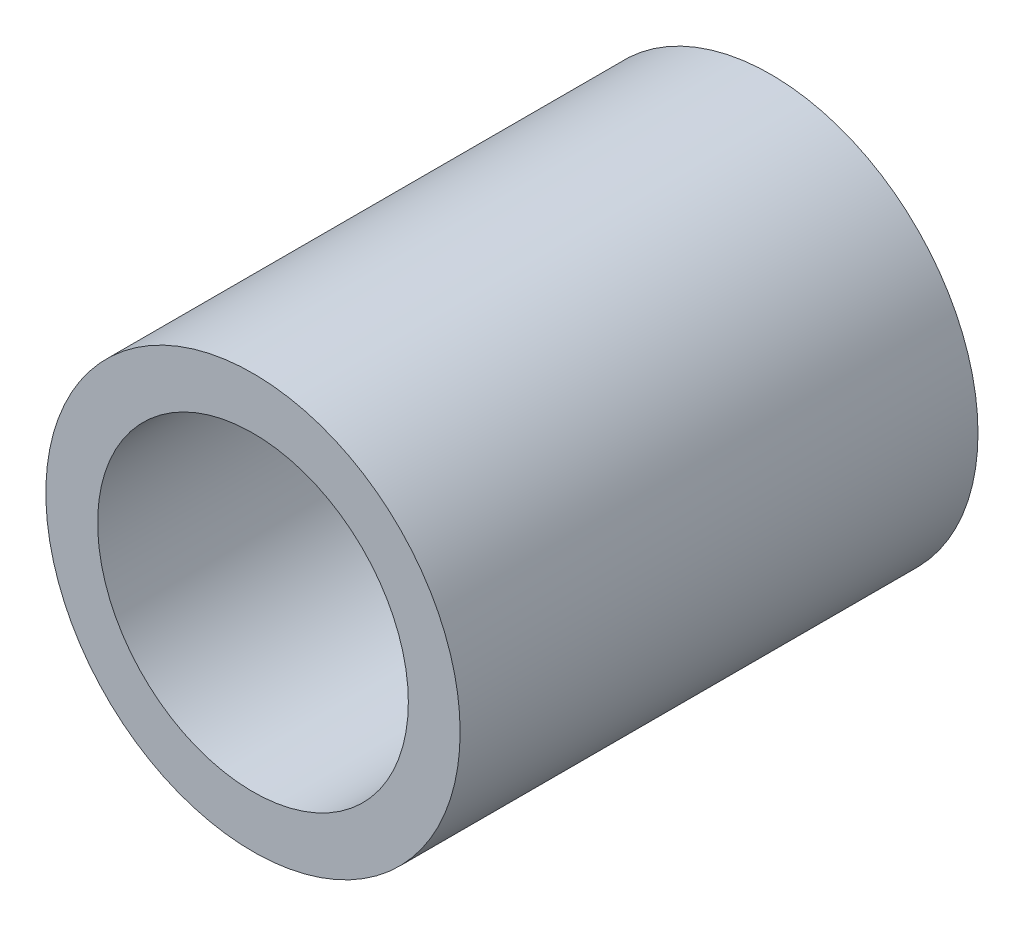
ISO-10303-21;
HEADER;
FILE_DESCRIPTION(('STEP AP214'),'2;1');
FILE_NAME('part.step','',(''),(''),'','','');
FILE_SCHEMA(('AUTOMOTIVE_DESIGN { 1 0 10303 214 1 1 1 1 }'));
ENDSEC;
DATA;
#1=APPLICATION_CONTEXT('core data for automotive mechanical design processes');
#2=APPLICATION_PROTOCOL_DEFINITION('international standard','automotive_design',2000,#1);
#3=PRODUCT_CONTEXT('',#1,'mechanical');
#4=PRODUCT('Part','Part','',(#3));
#5=PRODUCT_RELATED_PRODUCT_CATEGORY('part','',(#4));
#6=PRODUCT_DEFINITION_FORMATION('','',#4);
#7=PRODUCT_DEFINITION_CONTEXT('part definition',#1,'design');
#8=PRODUCT_DEFINITION('design','',#6,#7);
#9=PRODUCT_DEFINITION_SHAPE('','',#8);
#10=(LENGTH_UNIT() NAMED_UNIT(*) SI_UNIT(.MILLI.,.METRE.));
#11=(NAMED_UNIT(*) PLANE_ANGLE_UNIT() SI_UNIT($,.RADIAN.));
#12=(NAMED_UNIT(*) SI_UNIT($,.STERADIAN.) SOLID_ANGLE_UNIT());
#13=UNCERTAINTY_MEASURE_WITH_UNIT(LENGTH_MEASURE(1.E-05),#10,'distance_accuracy_value','');
#14=(GEOMETRIC_REPRESENTATION_CONTEXT(3) GLOBAL_UNCERTAINTY_ASSIGNED_CONTEXT((#13)) GLOBAL_UNIT_ASSIGNED_CONTEXT((#10,
#11,#12)) REPRESENTATION_CONTEXT('',''));
#15=CARTESIAN_POINT('',(0.,0.,0.));
#16=DIRECTION('',(0.,0.,1.));
#17=DIRECTION('',(1.,0.,0.));
#18=AXIS2_PLACEMENT_3D('',#15,#16,#17);
#19=CARTESIAN_POINT('',(0.,0.,10.));
#20=DIRECTION('',(0.,0.,1.));
#21=DIRECTION('',(1.,0.,0.));
#22=AXIS2_PLACEMENT_3D('',#19,#20,#21);
#23=PLANE('',#22);
#24=CARTESIAN_POINT('',(0.,0.,10.));
#25=DIRECTION('',(0.,0.,1.));
#26=DIRECTION('',(1.,0.,0.));
#27=AXIS2_PLACEMENT_3D('',#24,#25,#26);
#28=CIRCLE('',#27,8.);
#29=CARTESIAN_POINT('',(8.,0.,10.));
#30=VERTEX_POINT('',#29);
#31=EDGE_CURVE('E10',#30,#30,#28,.T.);
#32=ORIENTED_EDGE('',*,*,#31,.T.);
#33=EDGE_LOOP('',(#32));
#34=FACE_BOUND('',#33,.T.);
#35=CARTESIAN_POINT('',(0.,0.,10.));
#36=DIRECTION('',(0.,0.,1.));
#37=DIRECTION('',(1.,0.,0.));
#38=AXIS2_PLACEMENT_3D('',#35,#36,#37);
#39=CIRCLE('',#38,6.);
#40=CARTESIAN_POINT('',(6.,0.,10.));
#41=VERTEX_POINT('',#40);
#42=EDGE_CURVE('E41',#41,#41,#39,.T.);
#43=ORIENTED_EDGE('',*,*,#42,.F.);
#44=EDGE_LOOP('',(#43));
#45=FACE_BOUND('',#44,.T.);
#46=ADVANCED_FACE('F30',(#34,#45),#23,.T.);
#47=CARTESIAN_POINT('',(0.,0.,-10.));
#48=DIRECTION('',(0.,0.,1.));
#49=DIRECTION('',(1.,0.,0.));
#50=AXIS2_PLACEMENT_3D('',#47,#48,#49);
#51=PLANE('',#50);
#52=CARTESIAN_POINT('',(0.,0.,-10.));
#53=DIRECTION('',(0.,0.,1.));
#54=DIRECTION('',(1.,0.,0.));
#55=AXIS2_PLACEMENT_3D('',#52,#53,#54);
#56=CIRCLE('',#55,8.);
#57=CARTESIAN_POINT('',(8.,0.,-10.));
#58=VERTEX_POINT('',#57);
#59=EDGE_CURVE('E34',#58,#58,#56,.T.);
#60=ORIENTED_EDGE('',*,*,#59,.F.);
#61=EDGE_LOOP('',(#60));
#62=FACE_BOUND('',#61,.T.);
#63=CARTESIAN_POINT('',(0.,0.,-10.));
#64=DIRECTION('',(0.,0.,1.));
#65=DIRECTION('',(1.,0.,0.));
#66=AXIS2_PLACEMENT_3D('',#63,#64,#65);
#67=CIRCLE('',#66,6.);
#68=CARTESIAN_POINT('',(6.,0.,-10.));
#69=VERTEX_POINT('',#68);
#70=EDGE_CURVE('E43',#69,#69,#67,.T.);
#71=ORIENTED_EDGE('',*,*,#70,.T.);
#72=EDGE_LOOP('',(#71));
#73=FACE_BOUND('',#72,.T.);
#74=ADVANCED_FACE('F53',(#62,#73),#51,.F.);
#75=CARTESIAN_POINT('',(0.,0.,10.));
#76=DIRECTION('',(0.,0.,-1.));
#77=DIRECTION('',(-1.,0.,0.));
#78=AXIS2_PLACEMENT_3D('',#75,#76,#77);
#79=CYLINDRICAL_SURFACE('',#78,8.);
#80=ORIENTED_EDGE('',*,*,#31,.F.);
#81=EDGE_LOOP('',(#80));
#82=FACE_BOUND('',#81,.T.);
#83=ORIENTED_EDGE('',*,*,#59,.T.);
#84=EDGE_LOOP('',(#83));
#85=FACE_BOUND('',#84,.T.);
#86=ADVANCED_FACE('F32',(#82,#85),#79,.T.);
#87=CARTESIAN_POINT('',(0.,0.,10.));
#88=DIRECTION('',(0.,0.,-1.));
#89=DIRECTION('',(-1.,0.,0.));
#90=AXIS2_PLACEMENT_3D('',#87,#88,#89);
#91=CYLINDRICAL_SURFACE('',#90,6.);
#92=ORIENTED_EDGE('',*,*,#42,.T.);
#93=EDGE_LOOP('',(#92));
#94=FACE_BOUND('',#93,.T.);
#95=ORIENTED_EDGE('',*,*,#70,.F.);
#96=EDGE_LOOP('',(#95));
#97=FACE_BOUND('',#96,.T.);
#98=ADVANCED_FACE('F49',(#94,#97),#91,.F.);
#99=CLOSED_SHELL('',(#46,#74,#86,#98));
#100=MANIFOLD_SOLID_BREP('B2',#99);
#101=ADVANCED_BREP_SHAPE_REPRESENTATION('',(#18,#100),#14);
#102=SHAPE_DEFINITION_REPRESENTATION(#9,#101);
ENDSEC;
END-ISO-10303-21;
